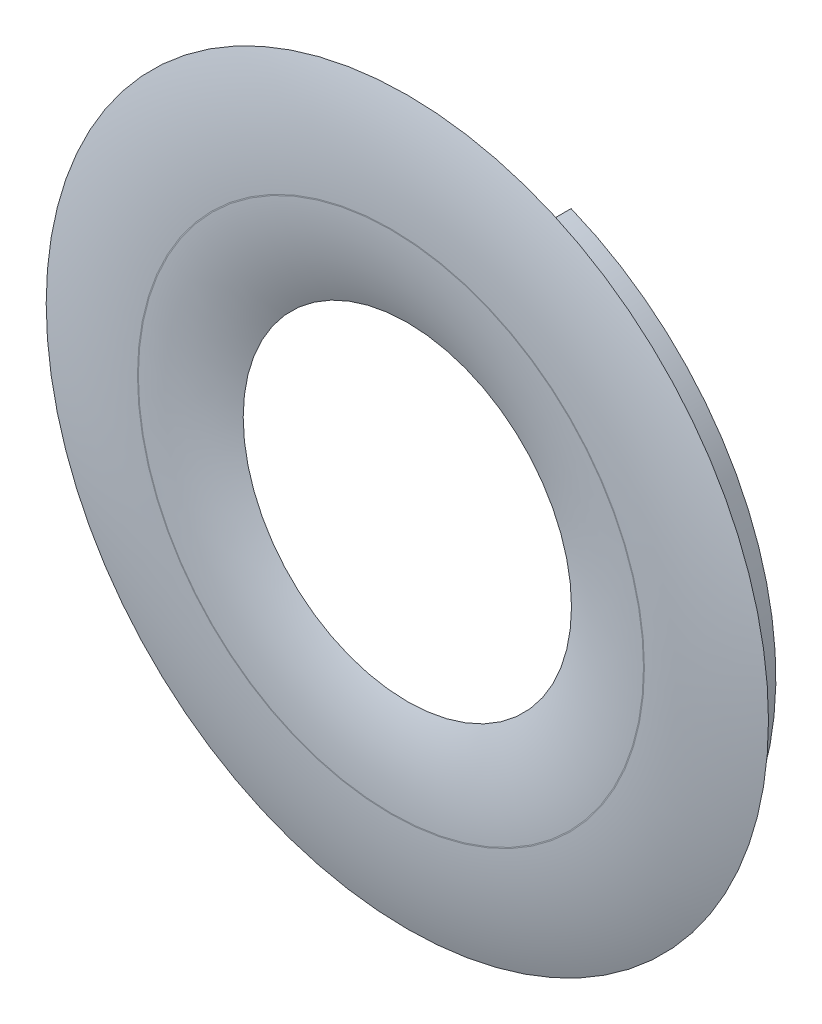
ISO-10303-21;
HEADER;
FILE_DESCRIPTION(('STEP AP214'),'2;1');
FILE_NAME('part.step','',(''),(''),'','','');
FILE_SCHEMA(('AUTOMOTIVE_DESIGN { 1 0 10303 214 1 1 1 1 }'));
ENDSEC;
DATA;
#1=APPLICATION_CONTEXT('core data for automotive mechanical design processes');
#2=APPLICATION_PROTOCOL_DEFINITION('international standard','automotive_design',2000,#1);
#3=PRODUCT_CONTEXT('',#1,'mechanical');
#4=PRODUCT('Part','Part','',(#3));
#5=PRODUCT_RELATED_PRODUCT_CATEGORY('part','',(#4));
#6=PRODUCT_DEFINITION_FORMATION('','',#4);
#7=PRODUCT_DEFINITION_CONTEXT('part definition',#1,'design');
#8=PRODUCT_DEFINITION('design','',#6,#7);
#9=PRODUCT_DEFINITION_SHAPE('','',#8);
#10=(LENGTH_UNIT() NAMED_UNIT(*) SI_UNIT(.MILLI.,.METRE.));
#11=(NAMED_UNIT(*) PLANE_ANGLE_UNIT() SI_UNIT($,.RADIAN.));
#12=(NAMED_UNIT(*) SI_UNIT($,.STERADIAN.) SOLID_ANGLE_UNIT());
#13=UNCERTAINTY_MEASURE_WITH_UNIT(LENGTH_MEASURE(1.E-05),#10,'distance_accuracy_value','');
#14=(GEOMETRIC_REPRESENTATION_CONTEXT(3) GLOBAL_UNCERTAINTY_ASSIGNED_CONTEXT((#13)) GLOBAL_UNIT_ASSIGNED_CONTEXT((#10,
#11,#12)) REPRESENTATION_CONTEXT('',''));
#15=CARTESIAN_POINT('',(0.,0.,0.));
#16=DIRECTION('',(0.,0.,1.));
#17=DIRECTION('',(1.,0.,0.));
#18=AXIS2_PLACEMENT_3D('',#15,#16,#17);
#19=CARTESIAN_POINT('',(0.,0.,-2.5));
#20=DIRECTION('',(0.,0.,1.));
#21=DIRECTION('',(1.,0.,0.));
#22=AXIS2_PLACEMENT_3D('',#19,#20,#21);
#23=CYLINDRICAL_SURFACE('',#22,19.95);
#24=DIRECTION('',(0.,0.,1.));
#25=VECTOR('',#24,1.);
#26=CARTESIAN_POINT('',(-7.52338683079396,18.4770438813744,-2.5));
#27=LINE('',#26,#25);
#28=CARTESIAN_POINT('',(-7.52338683079396,18.4770438813744,-2.5));
#29=VERTEX_POINT('',#28);
#30=CARTESIAN_POINT('',(-7.52338683079396,18.4770438813744,0.));
#31=VERTEX_POINT('',#30);
#32=EDGE_CURVE('E90',#29,#31,#27,.T.);
#33=ORIENTED_EDGE('',*,*,#32,.F.);
#34=CARTESIAN_POINT('',(0.,0.,-2.5));
#35=DIRECTION('',(0.,0.,-1.));
#36=DIRECTION('',(-1.,0.,0.));
#37=AXIS2_PLACEMENT_3D('',#34,#35,#36);
#38=CIRCLE('',#37,19.95);
#39=CARTESIAN_POINT('',(7.47661316920604,18.4960199912861,-2.5));
#40=VERTEX_POINT('',#39);
#41=EDGE_CURVE('E164',#40,#29,#38,.T.);
#42=ORIENTED_EDGE('',*,*,#41,.F.);
#43=DIRECTION('',(0.,0.,1.));
#44=VECTOR('',#43,1.);
#45=CARTESIAN_POINT('',(7.47661316920604,18.4960199912861,-2.5));
#46=LINE('',#45,#44);
#47=CARTESIAN_POINT('',(7.47661316920604,18.4960199912861,0.));
#48=VERTEX_POINT('',#47);
#49=EDGE_CURVE('E113',#48,#40,#46,.F.);
#50=ORIENTED_EDGE('',*,*,#49,.F.);
#51=CARTESIAN_POINT('',(0.,0.,0.));
#52=DIRECTION('',(0.,0.,1.));
#53=DIRECTION('',(1.,0.,0.));
#54=AXIS2_PLACEMENT_3D('',#51,#52,#53);
#55=CIRCLE('',#54,19.95);
#56=EDGE_CURVE('E107',#48,#31,#55,.F.);
#57=ORIENTED_EDGE('',*,*,#56,.T.);
#58=EDGE_LOOP('',(#33,#42,#50,#57));
#59=FACE_BOUND('',#58,.T.);
#60=ADVANCED_FACE('F39',(#59),#23,.T.);
#61=CARTESIAN_POINT('',(0.,0.,-2.5));
#62=DIRECTION('',(0.,0.,-1.));
#63=DIRECTION('',(-1.,0.,0.));
#64=AXIS2_PLACEMENT_3D('',#61,#62,#63);
#65=PLANE('',#64);
#66=ORIENTED_EDGE('',*,*,#41,.T.);
#67=DIRECTION('',(0.,-1.,0.));
#68=VECTOR('',#67,1.);
#69=CARTESIAN_POINT('',(-7.52338683079396,0.,-2.5));
#70=LINE('',#69,#68);
#71=CARTESIAN_POINT('',(-7.52338683079396,17.6646157782794,-2.5));
#72=VERTEX_POINT('',#71);
#73=EDGE_CURVE('E95',#29,#72,#70,.T.);
#74=ORIENTED_EDGE('',*,*,#73,.T.);
#75=CARTESIAN_POINT('',(0.,0.,-2.5));
#76=DIRECTION('',(0.,0.,-1.));
#77=DIRECTION('',(-1.,0.,0.));
#78=AXIS2_PLACEMENT_3D('',#75,#76,#77);
#79=CIRCLE('',#78,19.2);
#80=CARTESIAN_POINT('',(7.47661316920604,17.684463676291,-2.5));
#81=VERTEX_POINT('',#80);
#82=EDGE_CURVE('E100',#81,#72,#79,.T.);
#83=ORIENTED_EDGE('',*,*,#82,.F.);
#84=DIRECTION('',(0.,1.,0.));
#85=VECTOR('',#84,1.);
#86=CARTESIAN_POINT('',(7.47661316920604,0.,-2.5));
#87=LINE('',#86,#85);
#88=EDGE_CURVE('E181',#81,#40,#87,.T.);
#89=ORIENTED_EDGE('',*,*,#88,.T.);
#90=EDGE_LOOP('',(#66,#74,#83,#89));
#91=FACE_BOUND('',#90,.T.);
#92=ADVANCED_FACE('F141',(#91),#65,.T.);
#93=CARTESIAN_POINT('',(0.,0.,54.3058007951268));
#94=DIRECTION('',(0.,0.,-1.));
#95=DIRECTION('',(-1.,0.,0.));
#96=AXIS2_PLACEMENT_3D('',#93,#94,#95);
#97=CYLINDRICAL_SURFACE('',#96,19.2);
#98=DIRECTION('',(0.,0.,-1.));
#99=VECTOR('',#98,1.);
#100=CARTESIAN_POINT('',(-7.52338683079396,17.6646157782794,54.3058007951268));
#101=LINE('',#100,#99);
#102=CARTESIAN_POINT('',(-7.52338683079396,17.6646157782794,-1.));
#103=VERTEX_POINT('',#102);
#104=EDGE_CURVE('E117',#103,#72,#101,.T.);
#105=ORIENTED_EDGE('',*,*,#104,.F.);
#106=CARTESIAN_POINT('',(0.,0.,-1.));
#107=DIRECTION('',(0.,0.,1.));
#108=DIRECTION('',(1.,0.,0.));
#109=AXIS2_PLACEMENT_3D('',#106,#107,#108);
#110=CIRCLE('',#109,19.2);
#111=CARTESIAN_POINT('',(7.47661316920604,17.684463676291,-1.));
#112=VERTEX_POINT('',#111);
#113=EDGE_CURVE('E60',#103,#112,#110,.T.);
#114=ORIENTED_EDGE('',*,*,#113,.T.);
#115=DIRECTION('',(0.,0.,-1.));
#116=VECTOR('',#115,1.);
#117=CARTESIAN_POINT('',(7.47661316920604,17.684463676291,54.3058007951268));
#118=LINE('',#117,#116);
#119=EDGE_CURVE('E114',#81,#112,#118,.F.);
#120=ORIENTED_EDGE('',*,*,#119,.F.);
#121=ORIENTED_EDGE('',*,*,#82,.T.);
#122=EDGE_LOOP('',(#105,#114,#120,#121));
#123=FACE_BOUND('',#122,.T.);
#124=ADVANCED_FACE('F137',(#123),#97,.F.);
#125=CARTESIAN_POINT('',(0.,0.,1.));
#126=DIRECTION('',(0.,0.,1.));
#127=DIRECTION('',(1.,0.,0.));
#128=AXIS2_PLACEMENT_3D('',#125,#126,#127);
#129=PLANE('',#128);
#130=CARTESIAN_POINT('',(0.,0.,1.));
#131=DIRECTION('',(0.,0.,1.));
#132=DIRECTION('',(1.,0.,0.));
#133=AXIS2_PLACEMENT_3D('',#130,#131,#132);
#134=CIRCLE('',#133,15.3851648071345);
#135=CARTESIAN_POINT('',(15.3851648071345,0.,1.));
#136=VERTEX_POINT('',#135);
#137=EDGE_CURVE('E115',#136,#136,#134,.F.);
#138=ORIENTED_EDGE('',*,*,#137,.T.);
#139=EDGE_LOOP('',(#138));
#140=FACE_BOUND('',#139,.T.);
#141=CARTESIAN_POINT('',(0.,0.,1.));
#142=DIRECTION('',(0.,0.,1.));
#143=DIRECTION('',(1.,0.,0.));
#144=AXIS2_PLACEMENT_3D('',#141,#142,#143);
#145=CIRCLE('',#144,15.442561475698);
#146=CARTESIAN_POINT('',(15.442561475698,0.,1.));
#147=VERTEX_POINT('',#146);
#148=EDGE_CURVE('E120',#147,#147,#145,.T.);
#149=ORIENTED_EDGE('',*,*,#148,.T.);
#150=EDGE_LOOP('',(#149));
#151=FACE_BOUND('',#150,.T.);
#152=ADVANCED_FACE('F140',(#140,#151),#129,.T.);
#153=CARTESIAN_POINT('',(0.,0.,0.));
#154=DIRECTION('',(0.,0.,1.));
#155=DIRECTION('',(1.,0.,0.));
#156=AXIS2_PLACEMENT_3D('',#153,#154,#155);
#157=PLANE('',#156);
#158=CARTESIAN_POINT('',(0.,0.,0.));
#159=DIRECTION('',(0.,0.,1.));
#160=DIRECTION('',(1.,0.,0.));
#161=AXIS2_PLACEMENT_3D('',#158,#159,#160);
#162=CIRCLE('',#161,18.2);
#163=CARTESIAN_POINT('',(7.47661316920604,16.5933798702391,0.));
#164=VERTEX_POINT('',#163);
#165=CARTESIAN_POINT('',(-7.52338683079396,16.5722252758716,0.));
#166=VERTEX_POINT('',#165);
#167=EDGE_CURVE('E109',#164,#166,#162,.F.);
#168=ORIENTED_EDGE('',*,*,#167,.T.);
#169=DIRECTION('',(0.,1.,0.));
#170=VECTOR('',#169,1.);
#171=CARTESIAN_POINT('',(-7.52338683079396,20.296449372821,0.));
#172=LINE('',#171,#170);
#173=EDGE_CURVE('E93',#166,#31,#172,.T.);
#174=ORIENTED_EDGE('',*,*,#173,.T.);
#175=ORIENTED_EDGE('',*,*,#56,.F.);
#176=DIRECTION('',(0.,-1.,0.));
#177=VECTOR('',#176,1.);
#178=CARTESIAN_POINT('',(7.47661316920604,20.296449372821,0.));
#179=LINE('',#178,#177);
#180=EDGE_CURVE('E110',#48,#164,#179,.T.);
#181=ORIENTED_EDGE('',*,*,#180,.T.);
#182=EDGE_LOOP('',(#168,#174,#175,#181));
#183=FACE_BOUND('',#182,.T.);
#184=CARTESIAN_POINT('',(0.,0.,0.));
#185=DIRECTION('',(0.,0.,-1.));
#186=DIRECTION('',(-1.,0.,0.));
#187=AXIS2_PLACEMENT_3D('',#184,#185,#186);
#188=CIRCLE('',#187,10.);
#189=CARTESIAN_POINT('',(-10.,0.,0.));
#190=VERTEX_POINT('',#189);
#191=EDGE_CURVE('E163',#190,#190,#188,.F.);
#192=ORIENTED_EDGE('',*,*,#191,.T.);
#193=EDGE_LOOP('',(#192));
#194=FACE_BOUND('',#193,.T.);
#195=CARTESIAN_POINT('',(0.,0.,0.));
#196=DIRECTION('',(0.,0.,1.));
#197=DIRECTION('',(1.,0.,0.));
#198=AXIS2_PLACEMENT_3D('',#195,#196,#197);
#199=CIRCLE('',#198,22.);
#200=CARTESIAN_POINT('',(22.,0.,0.));
#201=VERTEX_POINT('',#200);
#202=EDGE_CURVE('E166',#201,#201,#199,.T.);
#203=ORIENTED_EDGE('',*,*,#202,.F.);
#204=EDGE_LOOP('',(#203));
#205=FACE_BOUND('',#204,.T.);
#206=ADVANCED_FACE('F105',(#183,#194,#205),#157,.F.);
#207=CARTESIAN_POINT('',(0.,0.,-21.));
#208=DIRECTION('',(0.,0.,-1.));
#209=DIRECTION('',(-1.,0.,0.));
#210=AXIS2_PLACEMENT_3D('',#207,#208,#209);
#211=DEGENERATE_TOROIDAL_SURFACE('',#210,15.442561475698,22.,.T.);
#212=ORIENTED_EDGE('',*,*,#202,.T.);
#213=EDGE_LOOP('',(#212));
#214=FACE_BOUND('',#213,.T.);
#215=ORIENTED_EDGE('',*,*,#148,.F.);
#216=EDGE_LOOP('',(#215));
#217=FACE_BOUND('',#216,.T.);
#218=ADVANCED_FACE('F152',(#214,#217),#211,.T.);
#219=CARTESIAN_POINT('',(0.,0.,-14.));
#220=DIRECTION('',(0.,0.,1.));
#221=DIRECTION('',(1.,0.,0.));
#222=AXIS2_PLACEMENT_3D('',#219,#220,#221);
#223=TOROIDAL_SURFACE('',#222,15.3851648071345,15.);
#224=ORIENTED_EDGE('',*,*,#137,.F.);
#225=EDGE_LOOP('',(#224));
#226=FACE_BOUND('',#225,.T.);
#227=ORIENTED_EDGE('',*,*,#191,.F.);
#228=EDGE_LOOP('',(#227));
#229=FACE_BOUND('',#228,.T.);
#230=ADVANCED_FACE('F135',(#226,#229),#223,.T.);
#231=CARTESIAN_POINT('',(-7.52338683079396,20.296449372821,-3.));
#232=DIRECTION('',(1.,0.,0.));
#233=DIRECTION('',(0.,0.,-1.));
#234=AXIS2_PLACEMENT_3D('',#231,#232,#233);
#235=PLANE('',#234);
#236=ORIENTED_EDGE('',*,*,#32,.T.);
#237=ORIENTED_EDGE('',*,*,#173,.F.);
#238=CARTESIAN_POINT('',(-7.52338683079396,16.5722252758716,0.));
#239=CARTESIAN_POINT('',(-7.52338683079396,16.6382477984242,2.86311510702291E-05));
#240=CARTESIAN_POINT('',(-7.52338683079396,16.7043024591044,-0.00542105442539018));
#241=CARTESIAN_POINT('',(-7.52338683079396,16.8347634034124,-0.0271878618652587));
#242=CARTESIAN_POINT('',(-7.52338683079396,16.8991650802038,-0.0435325179807586));
#243=CARTESIAN_POINT('',(-7.52338683079396,17.0243599668029,-0.0870361564497869));
#244=CARTESIAN_POINT('',(-7.52338683079396,17.085146836247,-0.114213531710753));
#245=CARTESIAN_POINT('',(-7.52338683079396,17.2008693212419,-0.178941664763338));
#246=CARTESIAN_POINT('',(-7.52338683079396,17.2558117645203,-0.216480129697732));
#247=CARTESIAN_POINT('',(-7.52338683079396,17.3549381083822,-0.298815210603608));
#248=CARTESIAN_POINT('',(-7.52338683079396,17.3995482384484,-0.343097354468186));
#249=CARTESIAN_POINT('',(-7.52338683079396,17.4798480940498,-0.439170569140054));
#250=CARTESIAN_POINT('',(-7.52338683079396,17.5155388347801,-0.49096078432569));
#251=CARTESIAN_POINT('',(-7.52338683079396,17.573647399144,-0.595672699169411));
#252=CARTESIAN_POINT('',(-7.52338683079396,17.5969487733299,-0.648105465226377));
#253=CARTESIAN_POINT('',(-7.52338683079396,17.6336286415254,-0.756287961287282));
#254=CARTESIAN_POINT('',(-7.52338683079396,17.6470261388669,-0.812031116085731));
#255=CARTESIAN_POINT('',(-7.52338683079396,17.6583162328101,-0.89025060163806));
#256=CARTESIAN_POINT('',(-7.52338683079396,17.6606783865554,-0.912150915475002));
#257=CARTESIAN_POINT('',(-7.52338683079396,17.6638263581997,-0.95603031084557));
#258=CARTESIAN_POINT('',(-7.52338683079396,17.664614622573,-0.978009216847831));
#259=CARTESIAN_POINT('',(-7.52338683079396,17.6646157782794,-0.999999999999997));
#260=B_SPLINE_CURVE_WITH_KNOTS('',3,(#238,#239,#240,#241,#242,#243,#244,#245,#246,#247,#248,
#249,#250,#251,#252,#253,#254,#255,#256,#257,#258,#259),.UNSPECIFIED.,.F.,.F.,(4,2,2,2,2,2,2,2,
2,2,4),(0.,0.197896675677062,0.396295390435623,0.595032411802267,0.793534648841431,
0.981089296096575,1.16862258635526,1.3398683400912,1.51078465240231,1.57682201791402,
1.64275665392139),.UNSPECIFIED.);
#261=EDGE_CURVE('E53',#166,#103,#260,.T.);
#262=ORIENTED_EDGE('',*,*,#261,.T.);
#263=ORIENTED_EDGE('',*,*,#104,.T.);
#264=ORIENTED_EDGE('',*,*,#73,.F.);
#265=EDGE_LOOP('',(#236,#237,#262,#263,#264));
#266=FACE_BOUND('',#265,.T.);
#267=ADVANCED_FACE('F92',(#266),#235,.T.);
#268=CARTESIAN_POINT('',(7.47661316920604,20.296449372821,-3.));
#269=DIRECTION('',(-1.,0.,0.));
#270=DIRECTION('',(0.,0.,1.));
#271=AXIS2_PLACEMENT_3D('',#268,#269,#270);
#272=PLANE('',#271);
#273=ORIENTED_EDGE('',*,*,#49,.T.);
#274=ORIENTED_EDGE('',*,*,#88,.F.);
#275=ORIENTED_EDGE('',*,*,#119,.T.);
#276=CARTESIAN_POINT('',(7.47661316920604,17.684463676291,-1.));
#277=CARTESIAN_POINT('',(7.47661316920604,17.6844645835313,-0.973489845005526));
#278=CARTESIAN_POINT('',(7.47661316920604,17.6833183431579,-0.946992977789261));
#279=CARTESIAN_POINT('',(7.47661316920604,17.6787529374075,-0.894201083448511));
#280=CARTESIAN_POINT('',(7.47661316920604,17.6753342307304,-0.867906016673674));
#281=CARTESIAN_POINT('',(7.47661316920604,17.6617342863884,-0.789762893063965));
#282=CARTESIAN_POINT('',(7.47661316920604,17.6482088580086,-0.738458843771221));
#283=CARTESIAN_POINT('',(7.47661316920604,17.6127813709266,-0.638887695373297));
#284=CARTESIAN_POINT('',(7.47661316920604,17.5908814881335,-0.59061981118093));
#285=CARTESIAN_POINT('',(7.47661316920604,17.5395225515126,-0.498274154612911));
#286=CARTESIAN_POINT('',(7.47661316920604,17.5100603652137,-0.454198128990397));
#287=CARTESIAN_POINT('',(7.47661316920604,17.4435643207887,-0.369939750041118));
#288=CARTESIAN_POINT('',(7.47661316920604,17.4063231684472,-0.329921480879807));
#289=CARTESIAN_POINT('',(7.47661316920604,17.326073024237,-0.256176756854262));
#290=CARTESIAN_POINT('',(7.47661316920604,17.2830627697664,-0.222451683167085));
#291=CARTESIAN_POINT('',(7.47661316920604,17.1890894246327,-0.159555729758642));
#292=CARTESIAN_POINT('',(7.47661316920604,17.1377720030269,-0.130914848724841));
#293=CARTESIAN_POINT('',(7.47661316920604,17.0313056916999,-0.0819141716920052));
#294=CARTESIAN_POINT('',(7.47661316920604,16.9761544583104,-0.0615594942348427));
#295=CARTESIAN_POINT('',(7.47661316920604,16.8667623446703,-0.0303130927662837));
#296=CARTESIAN_POINT('',(7.47661316920604,16.812659038714,-0.018934788912225));
#297=CARTESIAN_POINT('',(7.47661316920604,16.7034926782314,-0.00377888375504987));
#298=CARTESIAN_POINT('',(7.47661316920604,16.6484314748948,1.20229936737529E-05));
#299=CARTESIAN_POINT('',(7.47661316920604,16.593379870239,0.));
#300=B_SPLINE_CURVE_WITH_KNOTS('',3,(#276,#277,#278,#279,#280,#281,#282,#283,#284,#285,#286,
#287,#288,#289,#290,#291,#292,#293,#294,#295,#296,#297,#298,#299),.UNSPECIFIED.,.F.,.F.,(4,2,2,
2,2,2,2,2,2,2,2,4),(0.,0.0794796045607756,0.158943170943864,0.31728396039861,0.475583636567727,
0.633948990030645,0.79724809957095,0.960583006567641,1.1361464530644,1.31181818440171,
1.47714716356544,1.64218596286044),.UNSPECIFIED.);
#301=EDGE_CURVE('E11',#112,#164,#300,.T.);
#302=ORIENTED_EDGE('',*,*,#301,.T.);
#303=ORIENTED_EDGE('',*,*,#180,.F.);
#304=EDGE_LOOP('',(#273,#274,#275,#302,#303));
#305=FACE_BOUND('',#304,.T.);
#306=ADVANCED_FACE('F134',(#305),#272,.T.);
#307=CARTESIAN_POINT('',(0.,0.,-1.));
#308=DIRECTION('',(0.,0.,1.));
#309=DIRECTION('',(1.,0.,0.));
#310=AXIS2_PLACEMENT_3D('',#307,#308,#309);
#311=TOROIDAL_SURFACE('',#310,18.2,1.);
#312=ORIENTED_EDGE('',*,*,#301,.F.);
#313=ORIENTED_EDGE('',*,*,#113,.F.);
#314=ORIENTED_EDGE('',*,*,#261,.F.);
#315=ORIENTED_EDGE('',*,*,#167,.F.);
#316=EDGE_LOOP('',(#312,#313,#314,#315));
#317=FACE_BOUND('',#316,.T.);
#318=ADVANCED_FACE('F41',(#317),#311,.F.);
#319=CLOSED_SHELL('',(#60,#92,#124,#152,#206,#218,#230,#267,#306,#318));
#320=MANIFOLD_SOLID_BREP('B2',#319);
#321=ADVANCED_BREP_SHAPE_REPRESENTATION('',(#18,#320),#14);
#322=SHAPE_DEFINITION_REPRESENTATION(#9,#321);
ENDSEC;
END-ISO-10303-21;
